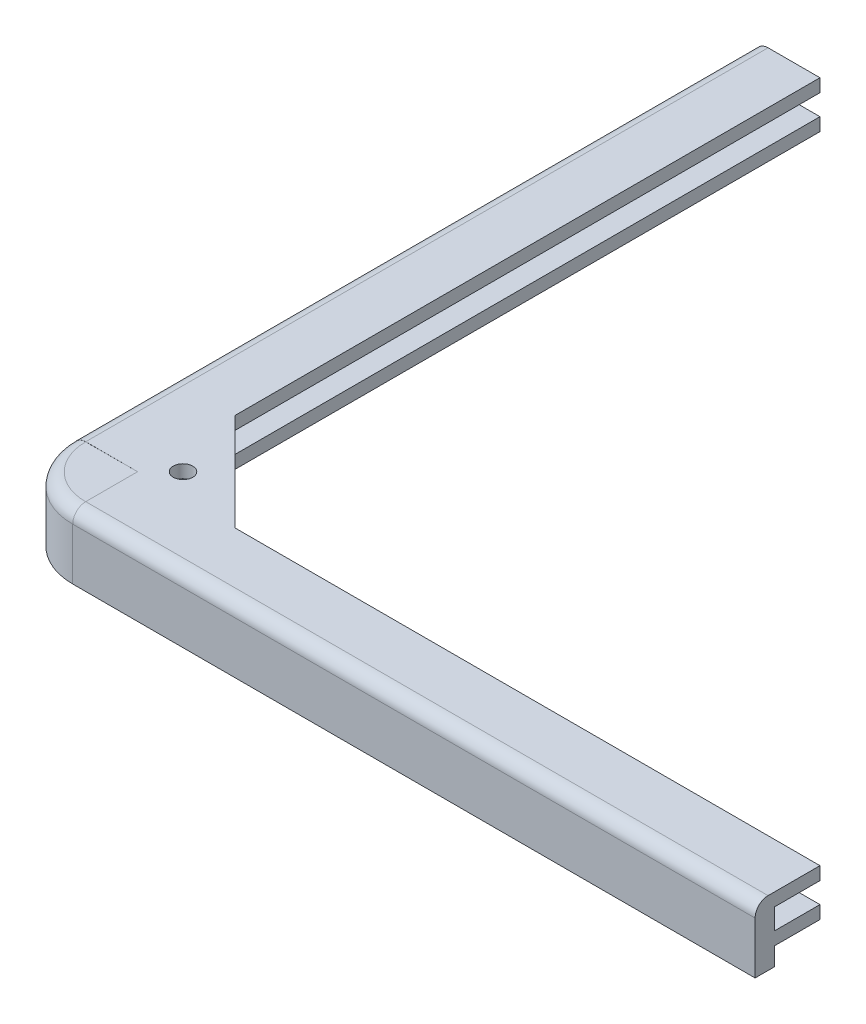
ISO-10303-21;
HEADER;
FILE_DESCRIPTION(('STEP AP214'),'2;1');
FILE_NAME('part.step','',(''),(''),'','','');
FILE_SCHEMA(('AUTOMOTIVE_DESIGN { 1 0 10303 214 1 1 1 1 }'));
ENDSEC;
DATA;
#1=APPLICATION_CONTEXT('core data for automotive mechanical design processes');
#2=APPLICATION_PROTOCOL_DEFINITION('international standard','automotive_design',2000,#1);
#3=PRODUCT_CONTEXT('',#1,'mechanical');
#4=PRODUCT('Part','Part','',(#3));
#5=PRODUCT_RELATED_PRODUCT_CATEGORY('part','',(#4));
#6=PRODUCT_DEFINITION_FORMATION('','',#4);
#7=PRODUCT_DEFINITION_CONTEXT('part definition',#1,'design');
#8=PRODUCT_DEFINITION('design','',#6,#7);
#9=PRODUCT_DEFINITION_SHAPE('','',#8);
#10=(LENGTH_UNIT() NAMED_UNIT(*) SI_UNIT(.MILLI.,.METRE.));
#11=(NAMED_UNIT(*) PLANE_ANGLE_UNIT() SI_UNIT($,.RADIAN.));
#12=(NAMED_UNIT(*) SI_UNIT($,.STERADIAN.) SOLID_ANGLE_UNIT());
#13=UNCERTAINTY_MEASURE_WITH_UNIT(LENGTH_MEASURE(1.E-05),#10,'distance_accuracy_value','');
#14=(GEOMETRIC_REPRESENTATION_CONTEXT(3) GLOBAL_UNCERTAINTY_ASSIGNED_CONTEXT((#13)) GLOBAL_UNIT_ASSIGNED_CONTEXT((#10,
#11,#12)) REPRESENTATION_CONTEXT('',''));
#15=CARTESIAN_POINT('',(0.,0.,0.));
#16=DIRECTION('',(0.,0.,1.));
#17=DIRECTION('',(1.,0.,0.));
#18=AXIS2_PLACEMENT_3D('',#15,#16,#17);
#19=CARTESIAN_POINT('',(105.2,10.,-10.));
#20=DIRECTION('',(0.,0.,1.));
#21=DIRECTION('',(0.,-1.,0.));
#22=AXIS2_PLACEMENT_3D('',#19,#20,#21);
#23=PLANE('',#22);
#24=DIRECTION('',(-1.,0.,0.));
#25=VECTOR('',#24,1.);
#26=CARTESIAN_POINT('',(105.2,8.,-10.));
#27=LINE('',#26,#25);
#28=CARTESIAN_POINT('',(105.2,8.,-10.));
#29=VERTEX_POINT('',#28);
#30=CARTESIAN_POINT('',(15.,8.,-10.));
#31=VERTEX_POINT('',#30);
#32=EDGE_CURVE('E64',#29,#31,#27,.T.);
#33=ORIENTED_EDGE('',*,*,#32,.T.);
#34=DIRECTION('',(0.,1.,0.));
#35=VECTOR('',#34,1.);
#36=CARTESIAN_POINT('',(15.,8.,-10.));
#37=LINE('',#36,#35);
#38=CARTESIAN_POINT('',(15.,10.,-10.));
#39=VERTEX_POINT('',#38);
#40=EDGE_CURVE('E59',#31,#39,#37,.T.);
#41=ORIENTED_EDGE('',*,*,#40,.T.);
#42=DIRECTION('',(-1.,0.,0.));
#43=VECTOR('',#42,1.);
#44=CARTESIAN_POINT('',(105.2,10.,-10.));
#45=LINE('',#44,#43);
#46=CARTESIAN_POINT('',(105.2,10.,-10.));
#47=VERTEX_POINT('',#46);
#48=EDGE_CURVE('E268',#47,#39,#45,.T.);
#49=ORIENTED_EDGE('',*,*,#48,.F.);
#50=DIRECTION('',(0.,1.,0.));
#51=VECTOR('',#50,1.);
#52=CARTESIAN_POINT('',(105.2,10.,-10.));
#53=LINE('',#52,#51);
#54=EDGE_CURVE('E267',#29,#47,#53,.T.);
#55=ORIENTED_EDGE('',*,*,#54,.F.);
#56=EDGE_LOOP('',(#33,#41,#49,#55));
#57=FACE_BOUND('',#56,.T.);
#58=ADVANCED_FACE('F40',(#57),#23,.F.);
#59=DIRECTION('',(0.,-1.,0.));
#60=VECTOR('',#59,1.);
#61=CARTESIAN_POINT('',(0.,2.80000000000001,-10.));
#62=LINE('',#61,#60);
#63=CARTESIAN_POINT('',(0.,4.8,-10.));
#64=VERTEX_POINT('',#63);
#65=CARTESIAN_POINT('',(0.,2.80000000000001,-10.));
#66=VERTEX_POINT('',#65);
#67=EDGE_CURVE('E465',#64,#66,#62,.T.);
#68=ORIENTED_EDGE('',*,*,#67,.F.);
#69=DIRECTION('',(-1.,0.,0.));
#70=VECTOR('',#69,1.);
#71=CARTESIAN_POINT('',(105.2,4.8,-10.));
#72=LINE('',#71,#70);
#73=CARTESIAN_POINT('',(105.2,4.8,-10.));
#74=VERTEX_POINT('',#73);
#75=EDGE_CURVE('E283',#74,#64,#72,.T.);
#76=ORIENTED_EDGE('',*,*,#75,.F.);
#77=DIRECTION('',(0.,1.,0.));
#78=VECTOR('',#77,1.);
#79=CARTESIAN_POINT('',(105.2,4.8,-10.));
#80=LINE('',#79,#78);
#81=CARTESIAN_POINT('',(105.2,2.8,-10.));
#82=VERTEX_POINT('',#81);
#83=EDGE_CURVE('E259',#82,#74,#80,.T.);
#84=ORIENTED_EDGE('',*,*,#83,.F.);
#85=DIRECTION('',(-1.,0.,0.));
#86=VECTOR('',#85,1.);
#87=CARTESIAN_POINT('',(105.2,2.8,-10.));
#88=LINE('',#87,#86);
#89=EDGE_CURVE('E286',#82,#66,#88,.T.);
#90=ORIENTED_EDGE('',*,*,#89,.T.);
#91=EDGE_LOOP('',(#68,#76,#84,#90));
#92=FACE_BOUND('',#91,.T.);
#93=ADVANCED_FACE('F320',(#92),#23,.F.);
#94=CARTESIAN_POINT('',(105.2,10.,0.));
#95=DIRECTION('',(0.,-1.,0.));
#96=DIRECTION('',(0.,0.,-1.));
#97=AXIS2_PLACEMENT_3D('',#94,#95,#96);
#98=PLANE('',#97);
#99=DIRECTION('',(0.,0.,1.));
#100=VECTOR('',#99,1.);
#101=CARTESIAN_POINT('',(0.,10.,0.));
#102=LINE('',#101,#100);
#103=CARTESIAN_POINT('',(0.,10.,-10.));
#104=VERTEX_POINT('',#103);
#105=CARTESIAN_POINT('',(0.,10.,-2.));
#106=VERTEX_POINT('',#105);
#107=EDGE_CURVE('E204',#104,#106,#102,.T.);
#108=ORIENTED_EDGE('',*,*,#107,.T.);
#109=DIRECTION('',(-1.,0.,0.));
#110=VECTOR('',#109,1.);
#111=CARTESIAN_POINT('',(105.2,10.,-2.));
#112=LINE('',#111,#110);
#113=CARTESIAN_POINT('',(105.2,10.,-2.));
#114=VERTEX_POINT('',#113);
#115=EDGE_CURVE('E51',#106,#114,#112,.F.);
#116=ORIENTED_EDGE('',*,*,#115,.T.);
#117=DIRECTION('',(0.,0.,1.));
#118=VECTOR('',#117,1.);
#119=CARTESIAN_POINT('',(105.2,10.,0.));
#120=LINE('',#119,#118);
#121=EDGE_CURVE('E247',#47,#114,#120,.T.);
#122=ORIENTED_EDGE('',*,*,#121,.F.);
#123=ORIENTED_EDGE('',*,*,#48,.T.);
#124=DIRECTION('',(-0.707106781186547,0.,-0.707106781186547));
#125=VECTOR('',#124,1.);
#126=CARTESIAN_POINT('',(0.,10.,-25.));
#127=LINE('',#126,#125);
#128=CARTESIAN_POINT('',(0.,10.,-25.));
#129=VERTEX_POINT('',#128);
#130=EDGE_CURVE('E508',#39,#129,#127,.T.);
#131=ORIENTED_EDGE('',*,*,#130,.T.);
#132=DIRECTION('',(0.,0.,1.));
#133=VECTOR('',#132,1.);
#134=CARTESIAN_POINT('',(0.,10.0000000000001,-115.2));
#135=LINE('',#134,#133);
#136=CARTESIAN_POINT('',(0.,10.0000000000001,-115.2));
#137=VERTEX_POINT('',#136);
#138=EDGE_CURVE('E496',#137,#129,#135,.T.);
#139=ORIENTED_EDGE('',*,*,#138,.F.);
#140=DIRECTION('',(1.,0.,0.));
#141=VECTOR('',#140,1.);
#142=CARTESIAN_POINT('',(0.,10.0000000000001,-115.2));
#143=LINE('',#142,#141);
#144=CARTESIAN_POINT('',(-7.99999999999998,10.0000000000001,-115.2));
#145=VERTEX_POINT('',#144);
#146=EDGE_CURVE('E484',#145,#137,#143,.T.);
#147=ORIENTED_EDGE('',*,*,#146,.F.);
#148=DIRECTION('',(0.,0.,1.));
#149=VECTOR('',#148,1.);
#150=CARTESIAN_POINT('',(-7.99999999999998,10.0000000000001,-115.2));
#151=LINE('',#150,#149);
#152=CARTESIAN_POINT('',(-7.99999999999998,10.,-10.));
#153=VERTEX_POINT('',#152);
#154=EDGE_CURVE('E208',#145,#153,#151,.T.);
#155=ORIENTED_EDGE('',*,*,#154,.T.);
#156=DIRECTION('',(1.,0.,0.));
#157=VECTOR('',#156,1.);
#158=CARTESIAN_POINT('',(0.,10.,-10.));
#159=LINE('',#158,#157);
#160=EDGE_CURVE('E199',#153,#104,#159,.T.);
#161=ORIENTED_EDGE('',*,*,#160,.T.);
#162=EDGE_LOOP('',(#108,#116,#122,#123,#131,#139,#147,#155,#161));
#163=FACE_BOUND('',#162,.T.);
#164=CARTESIAN_POINT('',(3.50000000000009,10.,-13.4999999999997));
#165=DIRECTION('',(0.,1.,0.));
#166=DIRECTION('',(0.,0.,1.));
#167=AXIS2_PLACEMENT_3D('',#164,#165,#166);
#168=CIRCLE('',#167,1.49999999999996);
#169=CARTESIAN_POINT('',(3.50000000000009,10.,-11.9999999999998));
#170=VERTEX_POINT('',#169);
#171=EDGE_CURVE('E517',#170,#170,#168,.T.);
#172=ORIENTED_EDGE('',*,*,#171,.F.);
#173=EDGE_LOOP('',(#172));
#174=FACE_BOUND('',#173,.T.);
#175=ADVANCED_FACE('F201',(#163,#174),#98,.F.);
#176=CARTESIAN_POINT('',(105.2,0.,0.));
#177=DIRECTION('',(0.,0.,-1.));
#178=DIRECTION('',(-1.,0.,0.));
#179=AXIS2_PLACEMENT_3D('',#176,#177,#178);
#180=PLANE('',#179);
#181=DIRECTION('',(0.,-1.,0.));
#182=VECTOR('',#181,1.);
#183=CARTESIAN_POINT('',(105.2,0.,0.));
#184=LINE('',#183,#182);
#185=CARTESIAN_POINT('',(105.2,8.,0.));
#186=VERTEX_POINT('',#185);
#187=CARTESIAN_POINT('',(105.2,0.,0.));
#188=VERTEX_POINT('',#187);
#189=EDGE_CURVE('E250',#186,#188,#184,.T.);
#190=ORIENTED_EDGE('',*,*,#189,.F.);
#191=DIRECTION('',(-1.,0.,0.));
#192=VECTOR('',#191,1.);
#193=CARTESIAN_POINT('',(105.2,8.,0.));
#194=LINE('',#193,#192);
#195=CARTESIAN_POINT('',(0.,7.995,0.));
#196=VERTEX_POINT('',#195);
#197=EDGE_CURVE('E411',#186,#196,#194,.T.);
#198=ORIENTED_EDGE('',*,*,#197,.T.);
#199=CARTESIAN_POINT('',(0.,0.,0.));
#200=DIRECTION('',(0.,1.,0.));
#201=VECTOR('',#200,1.);
#202=LINE('',#199,#201);
#203=CARTESIAN_POINT('',(0.,0.,0.));
#204=VERTEX_POINT('',#203);
#205=EDGE_CURVE('E232',#204,#196,#202,.T.);
#206=ORIENTED_EDGE('',*,*,#205,.F.);
#207=DIRECTION('',(-1.,0.,0.));
#208=VECTOR('',#207,1.);
#209=CARTESIAN_POINT('',(105.2,0.,0.));
#210=LINE('',#209,#208);
#211=EDGE_CURVE('E294',#188,#204,#210,.T.);
#212=ORIENTED_EDGE('',*,*,#211,.F.);
#213=EDGE_LOOP('',(#190,#198,#206,#212));
#214=FACE_BOUND('',#213,.T.);
#215=ADVANCED_FACE('F308',(#214),#180,.F.);
#216=CARTESIAN_POINT('',(105.2,0.,-3.));
#217=DIRECTION('',(0.,1.,0.));
#218=DIRECTION('',(0.,0.,1.));
#219=AXIS2_PLACEMENT_3D('',#216,#217,#218);
#220=PLANE('',#219);
#221=ORIENTED_EDGE('',*,*,#211,.T.);
#222=CARTESIAN_POINT('',(0.,0.,-10.));
#223=DIRECTION('',(0.,1.,0.));
#224=DIRECTION('',(-1.,0.,0.));
#225=AXIS2_PLACEMENT_3D('',#222,#223,#224);
#226=CIRCLE('',#225,10.);
#227=CARTESIAN_POINT('',(-10.,0.,-10.));
#228=VERTEX_POINT('',#227);
#229=EDGE_CURVE('E379',#228,#204,#226,.T.);
#230=ORIENTED_EDGE('',*,*,#229,.F.);
#231=DIRECTION('',(0.,0.,1.));
#232=VECTOR('',#231,1.);
#233=CARTESIAN_POINT('',(-10.,0.,-115.2));
#234=LINE('',#233,#232);
#235=CARTESIAN_POINT('',(-10.,0.,-115.2));
#236=VERTEX_POINT('',#235);
#237=EDGE_CURVE('E420',#236,#228,#234,.T.);
#238=ORIENTED_EDGE('',*,*,#237,.F.);
#239=DIRECTION('',(-1.,0.,0.));
#240=VECTOR('',#239,1.);
#241=CARTESIAN_POINT('',(-10.,0.,-115.2));
#242=LINE('',#241,#240);
#243=CARTESIAN_POINT('',(-7.,0.,-115.2));
#244=VERTEX_POINT('',#243);
#245=EDGE_CURVE('E479',#244,#236,#242,.T.);
#246=ORIENTED_EDGE('',*,*,#245,.F.);
#247=DIRECTION('',(0.,0.,1.));
#248=VECTOR('',#247,1.);
#249=CARTESIAN_POINT('',(-7.,0.,-115.2));
#250=LINE('',#249,#248);
#251=CARTESIAN_POINT('',(-7.,0.,-10.));
#252=VERTEX_POINT('',#251);
#253=EDGE_CURVE('E377',#244,#252,#250,.T.);
#254=ORIENTED_EDGE('',*,*,#253,.T.);
#255=CARTESIAN_POINT('',(0.,0.,-10.));
#256=DIRECTION('',(0.,1.,0.));
#257=DIRECTION('',(-1.,0.,0.));
#258=AXIS2_PLACEMENT_3D('',#255,#256,#257);
#259=CIRCLE('',#258,7.);
#260=CARTESIAN_POINT('',(0.,0.,-3.));
#261=VERTEX_POINT('',#260);
#262=EDGE_CURVE('E374',#252,#261,#259,.T.);
#263=ORIENTED_EDGE('',*,*,#262,.T.);
#264=DIRECTION('',(-1.,0.,0.));
#265=VECTOR('',#264,1.);
#266=CARTESIAN_POINT('',(105.2,0.,-3.));
#267=LINE('',#266,#265);
#268=CARTESIAN_POINT('',(105.2,0.,-3.));
#269=VERTEX_POINT('',#268);
#270=EDGE_CURVE('E291',#269,#261,#267,.T.);
#271=ORIENTED_EDGE('',*,*,#270,.F.);
#272=DIRECTION('',(0.,0.,-1.));
#273=VECTOR('',#272,1.);
#274=CARTESIAN_POINT('',(105.2,0.,-3.));
#275=LINE('',#274,#273);
#276=EDGE_CURVE('E253',#188,#269,#275,.T.);
#277=ORIENTED_EDGE('',*,*,#276,.F.);
#278=EDGE_LOOP('',(#221,#230,#238,#246,#254,#263,#271,#277));
#279=FACE_BOUND('',#278,.T.);
#280=ADVANCED_FACE('F317',(#279),#220,.F.);
#281=CARTESIAN_POINT('',(105.2,2.8,-3.));
#282=DIRECTION('',(0.,0.,1.));
#283=DIRECTION('',(1.,0.,0.));
#284=AXIS2_PLACEMENT_3D('',#281,#282,#283);
#285=PLANE('',#284);
#286=DIRECTION('',(0.,1.,0.));
#287=VECTOR('',#286,1.);
#288=CARTESIAN_POINT('',(0.,2.8,-3.));
#289=LINE('',#288,#287);
#290=CARTESIAN_POINT('',(0.,2.8,-3.));
#291=VERTEX_POINT('',#290);
#292=EDGE_CURVE('E270',#261,#291,#289,.T.);
#293=ORIENTED_EDGE('',*,*,#292,.T.);
#294=DIRECTION('',(-1.,0.,0.));
#295=VECTOR('',#294,1.);
#296=CARTESIAN_POINT('',(105.2,2.8,-3.));
#297=LINE('',#296,#295);
#298=CARTESIAN_POINT('',(105.2,2.8,-3.));
#299=VERTEX_POINT('',#298);
#300=EDGE_CURVE('E288',#299,#291,#297,.T.);
#301=ORIENTED_EDGE('',*,*,#300,.F.);
#302=DIRECTION('',(0.,1.,0.));
#303=VECTOR('',#302,1.);
#304=CARTESIAN_POINT('',(105.2,2.8,-3.));
#305=LINE('',#304,#303);
#306=EDGE_CURVE('E255',#269,#299,#305,.T.);
#307=ORIENTED_EDGE('',*,*,#306,.F.);
#308=ORIENTED_EDGE('',*,*,#270,.T.);
#309=EDGE_LOOP('',(#293,#301,#307,#308));
#310=FACE_BOUND('',#309,.T.);
#311=ADVANCED_FACE('F348',(#310),#285,.F.);
#312=CARTESIAN_POINT('',(105.2,2.8,-10.));
#313=DIRECTION('',(0.,1.,0.));
#314=DIRECTION('',(0.,0.,1.));
#315=AXIS2_PLACEMENT_3D('',#312,#313,#314);
#316=PLANE('',#315);
#317=ORIENTED_EDGE('',*,*,#300,.T.);
#318=CARTESIAN_POINT('',(0.,2.8,-10.));
#319=DIRECTION('',(0.,1.,0.));
#320=DIRECTION('',(-1.,0.,0.));
#321=AXIS2_PLACEMENT_3D('',#318,#319,#320);
#322=CIRCLE('',#321,7.);
#323=CARTESIAN_POINT('',(-7.,2.8,-10.));
#324=VERTEX_POINT('',#323);
#325=EDGE_CURVE('E364',#324,#291,#322,.T.);
#326=ORIENTED_EDGE('',*,*,#325,.F.);
#327=DIRECTION('',(0.,0.,1.));
#328=VECTOR('',#327,1.);
#329=CARTESIAN_POINT('',(-7.,2.80000000000009,-115.2));
#330=LINE('',#329,#328);
#331=CARTESIAN_POINT('',(-7.,2.80000000000009,-115.2));
#332=VERTEX_POINT('',#331);
#333=EDGE_CURVE('E428',#332,#324,#330,.T.);
#334=ORIENTED_EDGE('',*,*,#333,.F.);
#335=DIRECTION('',(-1.,0.,0.));
#336=VECTOR('',#335,1.);
#337=CARTESIAN_POINT('',(-7.,2.80000000000009,-115.2));
#338=LINE('',#337,#336);
#339=CARTESIAN_POINT('',(0.,2.8000000000001,-115.2));
#340=VERTEX_POINT('',#339);
#341=EDGE_CURVE('E469',#340,#332,#338,.T.);
#342=ORIENTED_EDGE('',*,*,#341,.F.);
#343=DIRECTION('',(0.,0.,1.));
#344=VECTOR('',#343,1.);
#345=CARTESIAN_POINT('',(0.,2.8000000000001,-115.2));
#346=LINE('',#345,#344);
#347=EDGE_CURVE('E435',#340,#66,#346,.T.);
#348=ORIENTED_EDGE('',*,*,#347,.T.);
#349=ORIENTED_EDGE('',*,*,#89,.F.);
#350=DIRECTION('',(0.,0.,-1.));
#351=VECTOR('',#350,1.);
#352=CARTESIAN_POINT('',(105.2,2.8,-10.));
#353=LINE('',#352,#351);
#354=EDGE_CURVE('E257',#299,#82,#353,.T.);
#355=ORIENTED_EDGE('',*,*,#354,.F.);
#356=EDGE_LOOP('',(#317,#326,#334,#342,#348,#349,#355));
#357=FACE_BOUND('',#356,.T.);
#358=ADVANCED_FACE('F345',(#357),#316,.F.);
#359=CARTESIAN_POINT('',(105.2,4.8,-3.));
#360=DIRECTION('',(0.,-1.,0.));
#361=DIRECTION('',(0.,0.,-1.));
#362=AXIS2_PLACEMENT_3D('',#359,#360,#361);
#363=PLANE('',#362);
#364=ORIENTED_EDGE('',*,*,#75,.T.);
#365=DIRECTION('',(0.,0.,1.));
#366=VECTOR('',#365,1.);
#367=CARTESIAN_POINT('',(0.,4.8000000000001,-115.2));
#368=LINE('',#367,#366);
#369=CARTESIAN_POINT('',(0.,4.8000000000001,-115.2));
#370=VERTEX_POINT('',#369);
#371=EDGE_CURVE('E437',#370,#64,#368,.T.);
#372=ORIENTED_EDGE('',*,*,#371,.F.);
#373=DIRECTION('',(1.,0.,0.));
#374=VECTOR('',#373,1.);
#375=CARTESIAN_POINT('',(0.,4.8000000000001,-115.2));
#376=LINE('',#375,#374);
#377=CARTESIAN_POINT('',(-7.,4.80000000000009,-115.2));
#378=VERTEX_POINT('',#377);
#379=EDGE_CURVE('E470',#378,#370,#376,.T.);
#380=ORIENTED_EDGE('',*,*,#379,.F.);
#381=DIRECTION('',(0.,0.,1.));
#382=VECTOR('',#381,1.);
#383=CARTESIAN_POINT('',(-7.,4.80000000000009,-115.2));
#384=LINE('',#383,#382);
#385=CARTESIAN_POINT('',(-7.,4.8,-10.));
#386=VERTEX_POINT('',#385);
#387=EDGE_CURVE('E440',#378,#386,#384,.T.);
#388=ORIENTED_EDGE('',*,*,#387,.T.);
#389=CARTESIAN_POINT('',(0.,4.8,-10.));
#390=DIRECTION('',(0.,1.,0.));
#391=DIRECTION('',(-1.,0.,0.));
#392=AXIS2_PLACEMENT_3D('',#389,#390,#391);
#393=CIRCLE('',#392,7.);
#394=CARTESIAN_POINT('',(0.,4.8,-3.));
#395=VERTEX_POINT('',#394);
#396=EDGE_CURVE('E383',#386,#395,#393,.T.);
#397=ORIENTED_EDGE('',*,*,#396,.T.);
#398=DIRECTION('',(-1.,0.,0.));
#399=VECTOR('',#398,1.);
#400=CARTESIAN_POINT('',(105.2,4.8,-3.));
#401=LINE('',#400,#399);
#402=CARTESIAN_POINT('',(105.2,4.8,-3.));
#403=VERTEX_POINT('',#402);
#404=EDGE_CURVE('E280',#403,#395,#401,.T.);
#405=ORIENTED_EDGE('',*,*,#404,.F.);
#406=DIRECTION('',(0.,0.,1.));
#407=VECTOR('',#406,1.);
#408=CARTESIAN_POINT('',(105.2,4.8,-3.));
#409=LINE('',#408,#407);
#410=EDGE_CURVE('E261',#74,#403,#409,.T.);
#411=ORIENTED_EDGE('',*,*,#410,.F.);
#412=EDGE_LOOP('',(#364,#372,#380,#388,#397,#405,#411));
#413=FACE_BOUND('',#412,.T.);
#414=ADVANCED_FACE('F341',(#413),#363,.F.);
#415=CARTESIAN_POINT('',(105.2,8.,-3.));
#416=DIRECTION('',(0.,0.,1.));
#417=DIRECTION('',(1.,0.,0.));
#418=AXIS2_PLACEMENT_3D('',#415,#416,#417);
#419=PLANE('',#418);
#420=DIRECTION('',(0.,1.,0.));
#421=VECTOR('',#420,1.);
#422=CARTESIAN_POINT('',(0.,8.,-3.));
#423=LINE('',#422,#421);
#424=CARTESIAN_POINT('',(0.,8.,-3.));
#425=VERTEX_POINT('',#424);
#426=EDGE_CURVE('E251',#395,#425,#423,.T.);
#427=ORIENTED_EDGE('',*,*,#426,.T.);
#428=DIRECTION('',(-1.,0.,0.));
#429=VECTOR('',#428,1.);
#430=CARTESIAN_POINT('',(105.2,8.,-3.));
#431=LINE('',#430,#429);
#432=CARTESIAN_POINT('',(105.2,8.,-3.));
#433=VERTEX_POINT('',#432);
#434=EDGE_CURVE('E277',#433,#425,#431,.T.);
#435=ORIENTED_EDGE('',*,*,#434,.F.);
#436=DIRECTION('',(0.,1.,0.));
#437=VECTOR('',#436,1.);
#438=CARTESIAN_POINT('',(105.2,8.,-3.));
#439=LINE('',#438,#437);
#440=EDGE_CURVE('E263',#403,#433,#439,.T.);
#441=ORIENTED_EDGE('',*,*,#440,.F.);
#442=ORIENTED_EDGE('',*,*,#404,.T.);
#443=EDGE_LOOP('',(#427,#435,#441,#442));
#444=FACE_BOUND('',#443,.T.);
#445=ADVANCED_FACE('F337',(#444),#419,.F.);
#446=CARTESIAN_POINT('',(105.2,8.,-10.));
#447=DIRECTION('',(0.,1.,0.));
#448=DIRECTION('',(0.,0.,1.));
#449=AXIS2_PLACEMENT_3D('',#446,#447,#448);
#450=PLANE('',#449);
#451=DIRECTION('',(-0.707106781186547,0.,-0.707106781186547));
#452=VECTOR('',#451,1.);
#453=CARTESIAN_POINT('',(0.,8.,-25.));
#454=LINE('',#453,#452);
#455=CARTESIAN_POINT('',(0.,8.00000000000002,-25.));
#456=VERTEX_POINT('',#455);
#457=EDGE_CURVE('E510',#31,#456,#454,.T.);
#458=ORIENTED_EDGE('',*,*,#457,.F.);
#459=ORIENTED_EDGE('',*,*,#32,.F.);
#460=DIRECTION('',(0.,0.,-1.));
#461=VECTOR('',#460,1.);
#462=CARTESIAN_POINT('',(105.2,8.,-10.));
#463=LINE('',#462,#461);
#464=EDGE_CURVE('E265',#433,#29,#463,.T.);
#465=ORIENTED_EDGE('',*,*,#464,.F.);
#466=ORIENTED_EDGE('',*,*,#434,.T.);
#467=CARTESIAN_POINT('',(0.,8.,-10.));
#468=DIRECTION('',(0.,1.,0.));
#469=DIRECTION('',(-1.,0.,0.));
#470=AXIS2_PLACEMENT_3D('',#467,#468,#469);
#471=CIRCLE('',#470,7.);
#472=CARTESIAN_POINT('',(-7.,8.,-10.));
#473=VERTEX_POINT('',#472);
#474=EDGE_CURVE('E223',#473,#425,#471,.T.);
#475=ORIENTED_EDGE('',*,*,#474,.F.);
#476=DIRECTION('',(0.,0.,1.));
#477=VECTOR('',#476,1.);
#478=CARTESIAN_POINT('',(-7.,8.00000000000009,-115.2));
#479=LINE('',#478,#477);
#480=CARTESIAN_POINT('',(-7.,8.00000000000009,-115.2));
#481=VERTEX_POINT('',#480);
#482=EDGE_CURVE('E443',#481,#473,#479,.T.);
#483=ORIENTED_EDGE('',*,*,#482,.F.);
#484=DIRECTION('',(-1.,0.,0.));
#485=VECTOR('',#484,1.);
#486=CARTESIAN_POINT('',(-7.,8.00000000000009,-115.2));
#487=LINE('',#486,#485);
#488=CARTESIAN_POINT('',(0.,8.0000000000001,-115.2));
#489=VERTEX_POINT('',#488);
#490=EDGE_CURVE('E211',#489,#481,#487,.T.);
#491=ORIENTED_EDGE('',*,*,#490,.F.);
#492=DIRECTION('',(0.,0.,1.));
#493=VECTOR('',#492,1.);
#494=CARTESIAN_POINT('',(0.,8.0000000000001,-115.2));
#495=LINE('',#494,#493);
#496=EDGE_CURVE('E488',#489,#456,#495,.T.);
#497=ORIENTED_EDGE('',*,*,#496,.T.);
#498=EDGE_LOOP('',(#458,#459,#465,#466,#475,#483,#491,#497));
#499=FACE_BOUND('',#498,.T.);
#500=CARTESIAN_POINT('',(3.50000000000009,8.,-13.4999999999997));
#501=DIRECTION('',(0.,1.,0.));
#502=DIRECTION('',(0.,0.,1.));
#503=AXIS2_PLACEMENT_3D('',#500,#501,#502);
#504=CIRCLE('',#503,1.49999999999996);
#505=CARTESIAN_POINT('',(3.50000000000009,8.,-11.9999999999998));
#506=VERTEX_POINT('',#505);
#507=EDGE_CURVE('E513',#506,#506,#504,.T.);
#508=ORIENTED_EDGE('',*,*,#507,.T.);
#509=EDGE_LOOP('',(#508));
#510=FACE_BOUND('',#509,.T.);
#511=ADVANCED_FACE('F333',(#499,#510),#450,.F.);
#512=CARTESIAN_POINT('',(105.2,0.,0.));
#513=DIRECTION('',(-1.,0.,0.));
#514=DIRECTION('',(0.,0.,1.));
#515=AXIS2_PLACEMENT_3D('',#512,#513,#514);
#516=PLANE('',#515);
#517=ORIENTED_EDGE('',*,*,#121,.T.);
#518=CARTESIAN_POINT('',(105.2,8.,-2.));
#519=DIRECTION('',(-1.,0.,0.));
#520=DIRECTION('',(0.,0.,1.));
#521=AXIS2_PLACEMENT_3D('',#518,#519,#520);
#522=CIRCLE('',#521,2.);
#523=EDGE_CURVE('E11',#114,#186,#522,.F.);
#524=ORIENTED_EDGE('',*,*,#523,.T.);
#525=ORIENTED_EDGE('',*,*,#189,.T.);
#526=ORIENTED_EDGE('',*,*,#276,.T.);
#527=ORIENTED_EDGE('',*,*,#306,.T.);
#528=ORIENTED_EDGE('',*,*,#354,.T.);
#529=ORIENTED_EDGE('',*,*,#83,.T.);
#530=ORIENTED_EDGE('',*,*,#410,.T.);
#531=ORIENTED_EDGE('',*,*,#440,.T.);
#532=ORIENTED_EDGE('',*,*,#464,.T.);
#533=ORIENTED_EDGE('',*,*,#54,.T.);
#534=EDGE_LOOP('',(#517,#524,#525,#526,#527,#528,#529,#530,#531,#532,#533));
#535=FACE_BOUND('',#534,.T.);
#536=ADVANCED_FACE('F336',(#535),#516,.F.);
#537=CARTESIAN_POINT('',(0.,0.,0.));
#538=DIRECTION('',(-1.,0.,0.));
#539=DIRECTION('',(0.,0.,1.));
#540=AXIS2_PLACEMENT_3D('',#537,#538,#539);
#541=PLANE('',#540);
#542=DIRECTION('',(0.,0.00216093270034977,-0.999997665182207));
#543=VECTOR('',#542,1.);
#544=CARTESIAN_POINT('',(0.,9.98270315875196,-1.99567813459932));
#545=LINE('',#544,#543);
#546=CARTESIAN_POINT('',(0.,9.98270315875196,-1.99567813459932));
#547=VERTEX_POINT('',#546);
#548=EDGE_CURVE('E229',#547,#104,#545,.T.);
#549=ORIENTED_EDGE('',*,*,#548,.F.);
#550=CARTESIAN_POINT('',(0.,7.98270782838754,-2.));
#551=DIRECTION('',(-1.,0.,0.));
#552=DIRECTION('',(0.,0.,1.));
#553=AXIS2_PLACEMENT_3D('',#550,#551,#552);
#554=CIRCLE('',#553,2.);
#555=EDGE_CURVE('E237',#196,#547,#554,.T.);
#556=ORIENTED_EDGE('',*,*,#555,.F.);
#557=CARTESIAN_POINT('',(0.,8.,-2.));
#558=DIRECTION('',(-1.,0.,0.));
#559=DIRECTION('',(0.,0.,1.));
#560=AXIS2_PLACEMENT_3D('',#557,#558,#559);
#561=CIRCLE('',#560,2.);
#562=EDGE_CURVE('E231',#196,#106,#561,.T.);
#563=ORIENTED_EDGE('',*,*,#562,.T.);
#564=ORIENTED_EDGE('',*,*,#107,.F.);
#565=EDGE_LOOP('',(#549,#556,#563,#564));
#566=FACE_BOUND('',#565,.T.);
#567=ADVANCED_FACE('F227',(#566),#541,.T.);
#568=CARTESIAN_POINT('',(105.2,8.,-2.));
#569=DIRECTION('',(-1.,0.,0.));
#570=DIRECTION('',(0.,0.,1.));
#571=AXIS2_PLACEMENT_3D('',#568,#569,#570);
#572=CYLINDRICAL_SURFACE('',#571,2.);
#573=ORIENTED_EDGE('',*,*,#523,.F.);
#574=ORIENTED_EDGE('',*,*,#115,.F.);
#575=ORIENTED_EDGE('',*,*,#562,.F.);
#576=ORIENTED_EDGE('',*,*,#197,.F.);
#577=EDGE_LOOP('',(#573,#574,#575,#576));
#578=FACE_BOUND('',#577,.T.);
#579=ADVANCED_FACE('F42',(#578),#572,.T.);
#580=CARTESIAN_POINT('',(0.,5.,-10.));
#581=DIRECTION('',(0.,1.,0.));
#582=DIRECTION('',(0.,0.,1.));
#583=AXIS2_PLACEMENT_3D('',#580,#581,#582);
#584=CYLINDRICAL_SURFACE('',#583,7.);
#585=ORIENTED_EDGE('',*,*,#396,.F.);
#586=DIRECTION('',(0.,-1.,0.));
#587=VECTOR('',#586,1.);
#588=CARTESIAN_POINT('',(-7.,8.,-10.));
#589=LINE('',#588,#587);
#590=EDGE_CURVE('E446',#473,#386,#589,.T.);
#591=ORIENTED_EDGE('',*,*,#590,.F.);
#592=ORIENTED_EDGE('',*,*,#474,.T.);
#593=ORIENTED_EDGE('',*,*,#426,.F.);
#594=EDGE_LOOP('',(#585,#591,#592,#593));
#595=FACE_BOUND('',#594,.T.);
#596=ADVANCED_FACE('F529',(#595),#584,.F.);
#597=CARTESIAN_POINT('',(0.,5.,-10.));
#598=DIRECTION('',(0.,1.,0.));
#599=DIRECTION('',(0.,0.,1.));
#600=AXIS2_PLACEMENT_3D('',#597,#598,#599);
#601=CYLINDRICAL_SURFACE('',#600,7.);
#602=ORIENTED_EDGE('',*,*,#262,.F.);
#603=DIRECTION('',(0.,-1.,0.));
#604=VECTOR('',#603,1.);
#605=CARTESIAN_POINT('',(-7.,2.8,-10.));
#606=LINE('',#605,#604);
#607=EDGE_CURVE('E387',#324,#252,#606,.T.);
#608=ORIENTED_EDGE('',*,*,#607,.F.);
#609=ORIENTED_EDGE('',*,*,#325,.T.);
#610=ORIENTED_EDGE('',*,*,#292,.F.);
#611=EDGE_LOOP('',(#602,#608,#609,#610));
#612=FACE_BOUND('',#611,.T.);
#613=ADVANCED_FACE('F566',(#612),#601,.F.);
#614=CARTESIAN_POINT('',(0.,5.,-10.));
#615=DIRECTION('',(0.,1.,0.));
#616=DIRECTION('',(0.,0.,1.));
#617=AXIS2_PLACEMENT_3D('',#614,#615,#616);
#618=CYLINDRICAL_SURFACE('',#617,10.);
#619=CARTESIAN_POINT('',(0.,7.98270782838753,-10.));
#620=DIRECTION('',(0.,1.,0.));
#621=DIRECTION('',(-1.,0.,0.));
#622=AXIS2_PLACEMENT_3D('',#619,#620,#621);
#623=CIRCLE('',#622,10.);
#624=CARTESIAN_POINT('',(-10.,7.98270782838753,-10.));
#625=VERTEX_POINT('',#624);
#626=EDGE_CURVE('E381',#625,#196,#623,.T.);
#627=ORIENTED_EDGE('',*,*,#626,.F.);
#628=DIRECTION('',(0.,1.,0.));
#629=VECTOR('',#628,1.);
#630=CARTESIAN_POINT('',(-10.,0.,-10.));
#631=LINE('',#630,#629);
#632=EDGE_CURVE('E388',#228,#625,#631,.T.);
#633=ORIENTED_EDGE('',*,*,#632,.F.);
#634=ORIENTED_EDGE('',*,*,#229,.T.);
#635=ORIENTED_EDGE('',*,*,#205,.T.);
#636=EDGE_LOOP('',(#627,#633,#634,#635));
#637=FACE_BOUND('',#636,.T.);
#638=ADVANCED_FACE('F404',(#637),#618,.T.);
#639=CARTESIAN_POINT('',(0.,7.98270782838754,-10.));
#640=DIRECTION('',(0.,1.,0.));
#641=DIRECTION('',(0.,0.,1.));
#642=AXIS2_PLACEMENT_3D('',#639,#640,#641);
#643=TOROIDAL_SURFACE('',#642,8.,2.);
#644=CARTESIAN_POINT('',(0.,9.98270315875196,-10.));
#645=DIRECTION('',(0.,1.,0.));
#646=DIRECTION('',(-1.,0.,0.));
#647=AXIS2_PLACEMENT_3D('',#644,#645,#646);
#648=CIRCLE('',#647,8.00432186540069);
#649=CARTESIAN_POINT('',(-8.00432186540069,9.98270315875196,-10.));
#650=VERTEX_POINT('',#649);
#651=EDGE_CURVE('E235',#650,#547,#648,.T.);
#652=ORIENTED_EDGE('',*,*,#651,.F.);
#653=CARTESIAN_POINT('',(-8.,7.98270782838754,-10.));
#654=DIRECTION('',(0.,0.,-1.));
#655=DIRECTION('',(-1.,0.,0.));
#656=AXIS2_PLACEMENT_3D('',#653,#654,#655);
#657=CIRCLE('',#656,2.);
#658=EDGE_CURVE('E218',#625,#650,#657,.T.);
#659=ORIENTED_EDGE('',*,*,#658,.F.);
#660=ORIENTED_EDGE('',*,*,#626,.T.);
#661=ORIENTED_EDGE('',*,*,#555,.T.);
#662=EDGE_LOOP('',(#652,#659,#660,#661));
#663=FACE_BOUND('',#662,.T.);
#664=ADVANCED_FACE('F571',(#663),#643,.T.);
#665=CARTESIAN_POINT('',(0.,9.98270315875196,-10.));
#666=DIRECTION('',(0.,-1.,0.));
#667=DIRECTION('',(0.,0.,-1.));
#668=AXIS2_PLACEMENT_3D('',#665,#666,#667);
#669=CONICAL_SURFACE('',#668,8.00432186540069,1.56863539241275);
#670=ORIENTED_EDGE('',*,*,#548,.T.);
#671=DIRECTION('',(0.999997665182207,0.00216093270034977,0.));
#672=VECTOR('',#671,1.);
#673=CARTESIAN_POINT('',(-8.00432186540069,9.98270315875196,-10.));
#674=LINE('',#673,#672);
#675=EDGE_CURVE('E215',#650,#104,#674,.T.);
#676=ORIENTED_EDGE('',*,*,#675,.F.);
#677=ORIENTED_EDGE('',*,*,#651,.T.);
#678=EDGE_LOOP('',(#670,#676,#677));
#679=FACE_BOUND('',#678,.T.);
#680=ADVANCED_FACE('F234',(#679),#669,.T.);
#681=CARTESIAN_POINT('',(-8.,8.,-10.));
#682=DIRECTION('',(0.,0.,-1.));
#683=DIRECTION('',(0.,1.,0.));
#684=AXIS2_PLACEMENT_3D('',#681,#682,#683);
#685=PLANE('',#684);
#686=DIRECTION('',(0.,1.,0.));
#687=VECTOR('',#686,1.);
#688=CARTESIAN_POINT('',(-10.,7.99999999999999,-10.));
#689=LINE('',#688,#687);
#690=CARTESIAN_POINT('',(-10.,7.99999999999999,-10.));
#691=VERTEX_POINT('',#690);
#692=EDGE_CURVE('E490',#625,#691,#689,.T.);
#693=ORIENTED_EDGE('',*,*,#692,.F.);
#694=ORIENTED_EDGE('',*,*,#658,.T.);
#695=ORIENTED_EDGE('',*,*,#675,.T.);
#696=ORIENTED_EDGE('',*,*,#160,.F.);
#697=CARTESIAN_POINT('',(-8.,8.,-10.));
#698=DIRECTION('',(0.,0.,-1.));
#699=DIRECTION('',(0.,1.,0.));
#700=AXIS2_PLACEMENT_3D('',#697,#698,#699);
#701=CIRCLE('',#700,2.);
#702=EDGE_CURVE('E212',#691,#153,#701,.T.);
#703=ORIENTED_EDGE('',*,*,#702,.F.);
#704=EDGE_LOOP('',(#693,#694,#695,#696,#703));
#705=FACE_BOUND('',#704,.T.);
#706=ADVANCED_FACE('F217',(#705),#685,.F.);
#707=CARTESIAN_POINT('',(-7.,4.80000000000009,-115.2));
#708=DIRECTION('',(-1.,0.,0.));
#709=DIRECTION('',(0.,0.,1.));
#710=AXIS2_PLACEMENT_3D('',#707,#708,#709);
#711=PLANE('',#710);
#712=ORIENTED_EDGE('',*,*,#590,.T.);
#713=ORIENTED_EDGE('',*,*,#387,.F.);
#714=DIRECTION('',(0.,-1.,0.));
#715=VECTOR('',#714,1.);
#716=CARTESIAN_POINT('',(-7.,4.80000000000009,-115.2));
#717=LINE('',#716,#715);
#718=EDGE_CURVE('E474',#481,#378,#717,.T.);
#719=ORIENTED_EDGE('',*,*,#718,.F.);
#720=ORIENTED_EDGE('',*,*,#482,.T.);
#721=EDGE_LOOP('',(#712,#713,#719,#720));
#722=FACE_BOUND('',#721,.T.);
#723=ADVANCED_FACE('F527',(#722),#711,.F.);
#724=CARTESIAN_POINT('',(0.,2.8000000000001,-115.2));
#725=DIRECTION('',(-1.,0.,0.));
#726=DIRECTION('',(0.,0.,1.));
#727=AXIS2_PLACEMENT_3D('',#724,#725,#726);
#728=PLANE('',#727);
#729=ORIENTED_EDGE('',*,*,#67,.T.);
#730=ORIENTED_EDGE('',*,*,#347,.F.);
#731=DIRECTION('',(0.,-1.,0.));
#732=VECTOR('',#731,1.);
#733=CARTESIAN_POINT('',(0.,2.8000000000001,-115.2));
#734=LINE('',#733,#732);
#735=EDGE_CURVE('E466',#370,#340,#734,.T.);
#736=ORIENTED_EDGE('',*,*,#735,.F.);
#737=ORIENTED_EDGE('',*,*,#371,.T.);
#738=EDGE_LOOP('',(#729,#730,#736,#737));
#739=FACE_BOUND('',#738,.T.);
#740=ADVANCED_FACE('F463',(#739),#728,.F.);
#741=CARTESIAN_POINT('',(-7.,0.,-115.2));
#742=DIRECTION('',(-1.,0.,0.));
#743=DIRECTION('',(0.,-1.,0.));
#744=AXIS2_PLACEMENT_3D('',#741,#742,#743);
#745=PLANE('',#744);
#746=ORIENTED_EDGE('',*,*,#607,.T.);
#747=ORIENTED_EDGE('',*,*,#253,.F.);
#748=DIRECTION('',(0.,-1.,0.));
#749=VECTOR('',#748,1.);
#750=CARTESIAN_POINT('',(-7.,0.,-115.2));
#751=LINE('',#750,#749);
#752=EDGE_CURVE('E472',#332,#244,#751,.T.);
#753=ORIENTED_EDGE('',*,*,#752,.F.);
#754=ORIENTED_EDGE('',*,*,#333,.T.);
#755=EDGE_LOOP('',(#746,#747,#753,#754));
#756=FACE_BOUND('',#755,.T.);
#757=ADVANCED_FACE('F556',(#756),#745,.F.);
#758=CARTESIAN_POINT('',(-10.,8.00000000000008,-115.2));
#759=DIRECTION('',(1.,0.,0.));
#760=DIRECTION('',(0.,1.,0.));
#761=AXIS2_PLACEMENT_3D('',#758,#759,#760);
#762=PLANE('',#761);
#763=ORIENTED_EDGE('',*,*,#632,.T.);
#764=ORIENTED_EDGE('',*,*,#692,.T.);
#765=DIRECTION('',(0.,0.,1.));
#766=VECTOR('',#765,1.);
#767=CARTESIAN_POINT('',(-10.,8.00000000000008,-115.2));
#768=LINE('',#767,#766);
#769=CARTESIAN_POINT('',(-10.,8.00000000000008,-115.2));
#770=VERTEX_POINT('',#769);
#771=EDGE_CURVE('E426',#770,#691,#768,.T.);
#772=ORIENTED_EDGE('',*,*,#771,.F.);
#773=DIRECTION('',(0.,1.,0.));
#774=VECTOR('',#773,1.);
#775=CARTESIAN_POINT('',(-10.,8.00000000000008,-115.2));
#776=LINE('',#775,#774);
#777=EDGE_CURVE('E425',#236,#770,#776,.T.);
#778=ORIENTED_EDGE('',*,*,#777,.F.);
#779=ORIENTED_EDGE('',*,*,#237,.T.);
#780=EDGE_LOOP('',(#763,#764,#772,#778,#779));
#781=FACE_BOUND('',#780,.T.);
#782=ADVANCED_FACE('F423',(#781),#762,.F.);
#783=CARTESIAN_POINT('',(-8.,8.00000000000009,-115.2));
#784=DIRECTION('',(0.,0.,1.));
#785=DIRECTION('',(0.,-1.,0.));
#786=AXIS2_PLACEMENT_3D('',#783,#784,#785);
#787=CYLINDRICAL_SURFACE('',#786,2.);
#788=ORIENTED_EDGE('',*,*,#702,.T.);
#789=ORIENTED_EDGE('',*,*,#154,.F.);
#790=CARTESIAN_POINT('',(-8.,8.00000000000009,-115.2));
#791=DIRECTION('',(0.,0.,-1.));
#792=DIRECTION('',(0.,1.,0.));
#793=AXIS2_PLACEMENT_3D('',#790,#791,#792);
#794=CIRCLE('',#793,2.);
#795=EDGE_CURVE('E482',#770,#145,#794,.T.);
#796=ORIENTED_EDGE('',*,*,#795,.F.);
#797=ORIENTED_EDGE('',*,*,#771,.T.);
#798=EDGE_LOOP('',(#788,#789,#796,#797));
#799=FACE_BOUND('',#798,.T.);
#800=ADVANCED_FACE('F550',(#799),#787,.T.);
#801=CARTESIAN_POINT('',(0.,8.0000000000001,-115.2));
#802=DIRECTION('',(-1.,0.,0.));
#803=DIRECTION('',(0.,-1.,0.));
#804=AXIS2_PLACEMENT_3D('',#801,#802,#803);
#805=PLANE('',#804);
#806=ORIENTED_EDGE('',*,*,#138,.T.);
#807=DIRECTION('',(0.,1.,0.));
#808=VECTOR('',#807,1.);
#809=CARTESIAN_POINT('',(0.,8.,-25.));
#810=LINE('',#809,#808);
#811=EDGE_CURVE('E491',#456,#129,#810,.T.);
#812=ORIENTED_EDGE('',*,*,#811,.F.);
#813=ORIENTED_EDGE('',*,*,#496,.F.);
#814=DIRECTION('',(0.,-1.,0.));
#815=VECTOR('',#814,1.);
#816=CARTESIAN_POINT('',(0.,8.0000000000001,-115.2));
#817=LINE('',#816,#815);
#818=EDGE_CURVE('E486',#137,#489,#817,.T.);
#819=ORIENTED_EDGE('',*,*,#818,.F.);
#820=EDGE_LOOP('',(#806,#812,#813,#819));
#821=FACE_BOUND('',#820,.T.);
#822=ADVANCED_FACE('F501',(#821),#805,.F.);
#823=CARTESIAN_POINT('',(-8.,8.00000000000009,-115.2));
#824=DIRECTION('',(0.,0.,-1.));
#825=DIRECTION('',(0.,1.,0.));
#826=AXIS2_PLACEMENT_3D('',#823,#824,#825);
#827=PLANE('',#826);
#828=ORIENTED_EDGE('',*,*,#490,.T.);
#829=ORIENTED_EDGE('',*,*,#718,.T.);
#830=ORIENTED_EDGE('',*,*,#379,.T.);
#831=ORIENTED_EDGE('',*,*,#735,.T.);
#832=ORIENTED_EDGE('',*,*,#341,.T.);
#833=ORIENTED_EDGE('',*,*,#752,.T.);
#834=ORIENTED_EDGE('',*,*,#245,.T.);
#835=ORIENTED_EDGE('',*,*,#777,.T.);
#836=ORIENTED_EDGE('',*,*,#795,.T.);
#837=ORIENTED_EDGE('',*,*,#146,.T.);
#838=ORIENTED_EDGE('',*,*,#818,.T.);
#839=EDGE_LOOP('',(#828,#829,#830,#831,#832,#833,#834,#835,#836,#837,#838));
#840=FACE_BOUND('',#839,.T.);
#841=ADVANCED_FACE('F523',(#840),#827,.T.);
#842=CARTESIAN_POINT('',(0.,8.,-25.));
#843=DIRECTION('',(0.707106781186547,0.,-0.707106781186547));
#844=DIRECTION('',(-0.707106781186548,0.,-0.707106781186548));
#845=AXIS2_PLACEMENT_3D('',#842,#843,#844);
#846=PLANE('',#845);
#847=ORIENTED_EDGE('',*,*,#130,.F.);
#848=ORIENTED_EDGE('',*,*,#40,.F.);
#849=ORIENTED_EDGE('',*,*,#457,.T.);
#850=ORIENTED_EDGE('',*,*,#811,.T.);
#851=EDGE_LOOP('',(#847,#848,#849,#850));
#852=FACE_BOUND('',#851,.T.);
#853=ADVANCED_FACE('F507',(#852),#846,.T.);
#854=CARTESIAN_POINT('',(3.50000000000009,8.,-13.4999999999997));
#855=DIRECTION('',(0.,1.,0.));
#856=DIRECTION('',(0.,0.,1.));
#857=AXIS2_PLACEMENT_3D('',#854,#855,#856);
#858=CYLINDRICAL_SURFACE('',#857,1.49999999999996);
#859=ORIENTED_EDGE('',*,*,#507,.F.);
#860=EDGE_LOOP('',(#859));
#861=FACE_BOUND('',#860,.T.);
#862=ORIENTED_EDGE('',*,*,#171,.T.);
#863=EDGE_LOOP('',(#862));
#864=FACE_BOUND('',#863,.T.);
#865=ADVANCED_FACE('F533',(#861,#864),#858,.F.);
#866=CLOSED_SHELL('',(#58,#93,#175,#215,#280,#311,#358,#414,#445,#511,#536,#567,#579,#596,#613,
#638,#664,#680,#706,#723,#740,#757,#782,#800,#822,#841,#853,#865));
#867=MANIFOLD_SOLID_BREP('B2',#866);
#868=ADVANCED_BREP_SHAPE_REPRESENTATION('',(#18,#867),#14);
#869=SHAPE_DEFINITION_REPRESENTATION(#9,#868);
ENDSEC;
END-ISO-10303-21;
